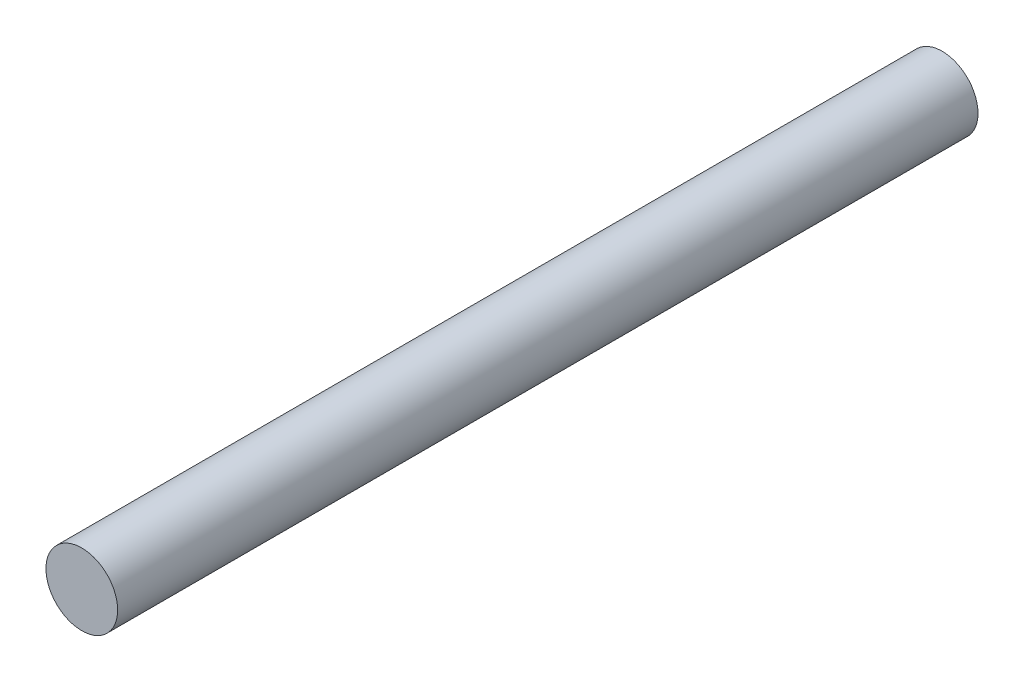
ISO-10303-21;
HEADER;
FILE_DESCRIPTION(('STEP AP214'),'2;1');
FILE_NAME('part.step','',(''),(''),'','','');
FILE_SCHEMA(('AUTOMOTIVE_DESIGN { 1 0 10303 214 1 1 1 1 }'));
ENDSEC;
DATA;
#1=APPLICATION_CONTEXT('core data for automotive mechanical design processes');
#2=APPLICATION_PROTOCOL_DEFINITION('international standard','automotive_design',2000,#1);
#3=PRODUCT_CONTEXT('',#1,'mechanical');
#4=PRODUCT('Part','Part','',(#3));
#5=PRODUCT_RELATED_PRODUCT_CATEGORY('part','',(#4));
#6=PRODUCT_DEFINITION_FORMATION('','',#4);
#7=PRODUCT_DEFINITION_CONTEXT('part definition',#1,'design');
#8=PRODUCT_DEFINITION('design','',#6,#7);
#9=PRODUCT_DEFINITION_SHAPE('','',#8);
#10=(LENGTH_UNIT() NAMED_UNIT(*) SI_UNIT(.MILLI.,.METRE.));
#11=(NAMED_UNIT(*) PLANE_ANGLE_UNIT() SI_UNIT($,.RADIAN.));
#12=(NAMED_UNIT(*) SI_UNIT($,.STERADIAN.) SOLID_ANGLE_UNIT());
#13=UNCERTAINTY_MEASURE_WITH_UNIT(LENGTH_MEASURE(1.E-05),#10,'distance_accuracy_value','');
#14=(GEOMETRIC_REPRESENTATION_CONTEXT(3) GLOBAL_UNCERTAINTY_ASSIGNED_CONTEXT((#13)) GLOBAL_UNIT_ASSIGNED_CONTEXT((#10,
#11,#12)) REPRESENTATION_CONTEXT('',''));
#15=CARTESIAN_POINT('',(0.,0.,0.));
#16=DIRECTION('',(0.,0.,1.));
#17=DIRECTION('',(1.,0.,0.));
#18=AXIS2_PLACEMENT_3D('',#15,#16,#17);
#19=CARTESIAN_POINT('',(0.,0.,120.));
#20=DIRECTION('',(0.,0.,-1.));
#21=DIRECTION('',(-1.,0.,0.));
#22=AXIS2_PLACEMENT_3D('',#19,#20,#21);
#23=CYLINDRICAL_SURFACE('',#22,5.);
#24=CARTESIAN_POINT('',(0.,0.,120.));
#25=DIRECTION('',(0.,0.,1.));
#26=DIRECTION('',(1.,0.,0.));
#27=AXIS2_PLACEMENT_3D('',#24,#25,#26);
#28=CIRCLE('',#27,5.);
#29=CARTESIAN_POINT('',(5.,0.,120.));
#30=VERTEX_POINT('',#29);
#31=EDGE_CURVE('E10',#30,#30,#28,.T.);
#32=ORIENTED_EDGE('',*,*,#31,.F.);
#33=EDGE_LOOP('',(#32));
#34=FACE_BOUND('',#33,.T.);
#35=CARTESIAN_POINT('',(0.,0.,0.));
#36=DIRECTION('',(0.,0.,1.));
#37=DIRECTION('',(1.,0.,0.));
#38=AXIS2_PLACEMENT_3D('',#35,#36,#37);
#39=CIRCLE('',#38,5.);
#40=CARTESIAN_POINT('',(5.,0.,0.));
#41=VERTEX_POINT('',#40);
#42=EDGE_CURVE('E33',#41,#41,#39,.T.);
#43=ORIENTED_EDGE('',*,*,#42,.T.);
#44=EDGE_LOOP('',(#43));
#45=FACE_BOUND('',#44,.T.);
#46=ADVANCED_FACE('F30',(#34,#45),#23,.T.);
#47=CARTESIAN_POINT('',(0.,0.,120.));
#48=DIRECTION('',(0.,0.,1.));
#49=DIRECTION('',(1.,0.,0.));
#50=AXIS2_PLACEMENT_3D('',#47,#48,#49);
#51=PLANE('',#50);
#52=ORIENTED_EDGE('',*,*,#31,.T.);
#53=EDGE_LOOP('',(#52));
#54=FACE_BOUND('',#53,.T.);
#55=ADVANCED_FACE('F45',(#54),#51,.T.);
#56=CARTESIAN_POINT('',(0.,0.,0.));
#57=DIRECTION('',(0.,0.,1.));
#58=DIRECTION('',(1.,0.,0.));
#59=AXIS2_PLACEMENT_3D('',#56,#57,#58);
#60=PLANE('',#59);
#61=ORIENTED_EDGE('',*,*,#42,.F.);
#62=EDGE_LOOP('',(#61));
#63=FACE_BOUND('',#62,.T.);
#64=ADVANCED_FACE('F43',(#63),#60,.F.);
#65=CLOSED_SHELL('',(#46,#55,#64));
#66=MANIFOLD_SOLID_BREP('B2',#65);
#67=ADVANCED_BREP_SHAPE_REPRESENTATION('',(#18,#66),#14);
#68=SHAPE_DEFINITION_REPRESENTATION(#9,#67);
ENDSEC;
END-ISO-10303-21;
